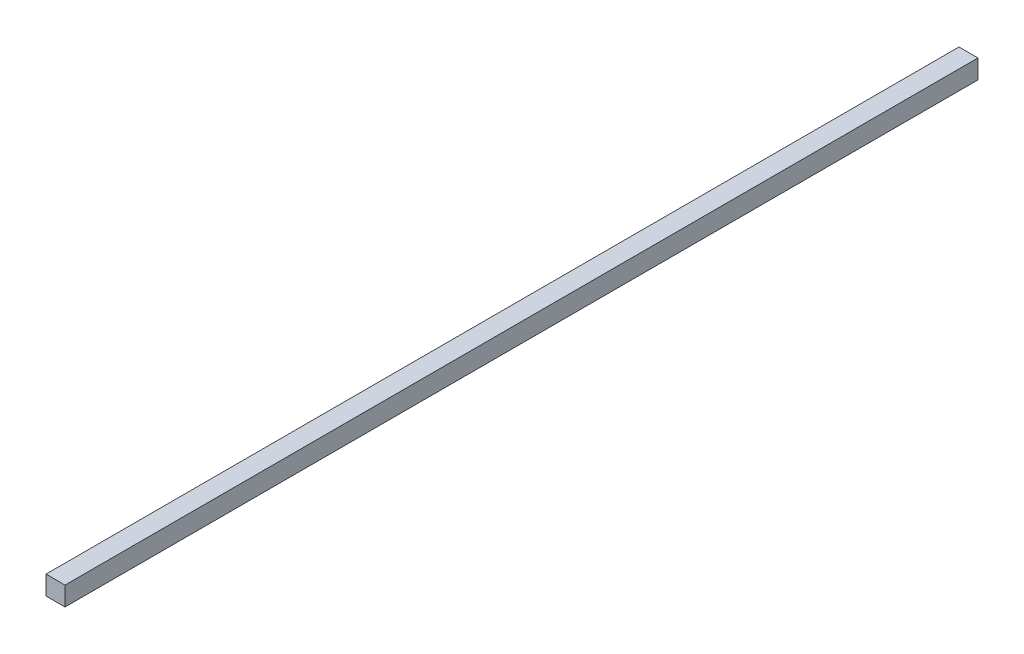
ISO-10303-21;
HEADER;
FILE_DESCRIPTION(('STEP AP214'),'2;1');
FILE_NAME('part.step','',(''),(''),'','','');
FILE_SCHEMA(('AUTOMOTIVE_DESIGN { 1 0 10303 214 1 1 1 1 }'));
ENDSEC;
DATA;
#1=APPLICATION_CONTEXT('core data for automotive mechanical design processes');
#2=APPLICATION_PROTOCOL_DEFINITION('international standard','automotive_design',2000,#1);
#3=PRODUCT_CONTEXT('',#1,'mechanical');
#4=PRODUCT('Part','Part','',(#3));
#5=PRODUCT_RELATED_PRODUCT_CATEGORY('part','',(#4));
#6=PRODUCT_DEFINITION_FORMATION('','',#4);
#7=PRODUCT_DEFINITION_CONTEXT('part definition',#1,'design');
#8=PRODUCT_DEFINITION('design','',#6,#7);
#9=PRODUCT_DEFINITION_SHAPE('','',#8);
#10=(LENGTH_UNIT() NAMED_UNIT(*) SI_UNIT(.MILLI.,.METRE.));
#11=(NAMED_UNIT(*) PLANE_ANGLE_UNIT() SI_UNIT($,.RADIAN.));
#12=(NAMED_UNIT(*) SI_UNIT($,.STERADIAN.) SOLID_ANGLE_UNIT());
#13=UNCERTAINTY_MEASURE_WITH_UNIT(LENGTH_MEASURE(1.E-05),#10,'distance_accuracy_value','');
#14=(GEOMETRIC_REPRESENTATION_CONTEXT(3) GLOBAL_UNCERTAINTY_ASSIGNED_CONTEXT((#13)) GLOBAL_UNIT_ASSIGNED_CONTEXT((#10,
#11,#12)) REPRESENTATION_CONTEXT('',''));
#15=CARTESIAN_POINT('',(0.,0.,0.));
#16=DIRECTION('',(0.,0.,1.));
#17=DIRECTION('',(1.,0.,0.));
#18=AXIS2_PLACEMENT_3D('',#15,#16,#17);
#19=CARTESIAN_POINT('',(0.,0.,152.4));
#20=DIRECTION('',(-1.,0.,0.));
#21=DIRECTION('',(0.,0.,1.));
#22=AXIS2_PLACEMENT_3D('',#19,#20,#21);
#23=PLANE('',#22);
#24=DIRECTION('',(0.,1.,0.));
#25=VECTOR('',#24,1.);
#26=CARTESIAN_POINT('',(0.,0.,-152.4));
#27=LINE('',#26,#25);
#28=CARTESIAN_POINT('',(0.,0.,-152.4));
#29=VERTEX_POINT('',#28);
#30=CARTESIAN_POINT('',(0.,6.35,-152.4));
#31=VERTEX_POINT('',#30);
#32=EDGE_CURVE('E102',#29,#31,#27,.T.);
#33=ORIENTED_EDGE('',*,*,#32,.T.);
#34=DIRECTION('',(0.,0.,-1.));
#35=VECTOR('',#34,1.);
#36=CARTESIAN_POINT('',(0.,6.35,152.4));
#37=LINE('',#36,#35);
#38=CARTESIAN_POINT('',(0.,6.35,152.4));
#39=VERTEX_POINT('',#38);
#40=EDGE_CURVE('E11',#39,#31,#37,.T.);
#41=ORIENTED_EDGE('',*,*,#40,.F.);
#42=DIRECTION('',(0.,1.,0.));
#43=VECTOR('',#42,1.);
#44=CARTESIAN_POINT('',(0.,0.,152.4));
#45=LINE('',#44,#43);
#46=CARTESIAN_POINT('',(0.,0.,152.4));
#47=VERTEX_POINT('',#46);
#48=EDGE_CURVE('E90',#47,#39,#45,.T.);
#49=ORIENTED_EDGE('',*,*,#48,.F.);
#50=DIRECTION('',(0.,0.,-1.));
#51=VECTOR('',#50,1.);
#52=CARTESIAN_POINT('',(0.,0.,152.4));
#53=LINE('',#52,#51);
#54=EDGE_CURVE('E98',#47,#29,#53,.T.);
#55=ORIENTED_EDGE('',*,*,#54,.T.);
#56=EDGE_LOOP('',(#33,#41,#49,#55));
#57=FACE_BOUND('',#56,.T.);
#58=ADVANCED_FACE('F39',(#57),#23,.F.);
#59=CARTESIAN_POINT('',(0.,6.35,152.4));
#60=DIRECTION('',(0.,-1.,0.));
#61=DIRECTION('',(1.,0.,0.));
#62=AXIS2_PLACEMENT_3D('',#59,#60,#61);
#63=PLANE('',#62);
#64=DIRECTION('',(-1.,0.,0.));
#65=VECTOR('',#64,1.);
#66=CARTESIAN_POINT('',(0.,6.35,-152.4));
#67=LINE('',#66,#65);
#68=CARTESIAN_POINT('',(-6.35,6.35,-152.4));
#69=VERTEX_POINT('',#68);
#70=EDGE_CURVE('E94',#31,#69,#67,.T.);
#71=ORIENTED_EDGE('',*,*,#70,.T.);
#72=DIRECTION('',(0.,0.,-1.));
#73=VECTOR('',#72,1.);
#74=CARTESIAN_POINT('',(-6.35,6.35,152.4));
#75=LINE('',#74,#73);
#76=CARTESIAN_POINT('',(-6.35,6.35,152.4));
#77=VERTEX_POINT('',#76);
#78=EDGE_CURVE('E47',#77,#69,#75,.T.);
#79=ORIENTED_EDGE('',*,*,#78,.F.);
#80=DIRECTION('',(-1.,0.,0.));
#81=VECTOR('',#80,1.);
#82=CARTESIAN_POINT('',(0.,6.35,152.4));
#83=LINE('',#82,#81);
#84=EDGE_CURVE('E85',#39,#77,#83,.T.);
#85=ORIENTED_EDGE('',*,*,#84,.F.);
#86=ORIENTED_EDGE('',*,*,#40,.T.);
#87=EDGE_LOOP('',(#71,#79,#85,#86));
#88=FACE_BOUND('',#87,.T.);
#89=ADVANCED_FACE('F93',(#88),#63,.F.);
#90=CARTESIAN_POINT('',(-6.35,0.,152.4));
#91=DIRECTION('',(1.,0.,0.));
#92=DIRECTION('',(0.,0.,-1.));
#93=AXIS2_PLACEMENT_3D('',#90,#91,#92);
#94=PLANE('',#93);
#95=DIRECTION('',(0.,-1.,0.));
#96=VECTOR('',#95,1.);
#97=CARTESIAN_POINT('',(-6.35,0.,-152.4));
#98=LINE('',#97,#96);
#99=CARTESIAN_POINT('',(-6.35,0.,-152.4));
#100=VERTEX_POINT('',#99);
#101=EDGE_CURVE('E72',#69,#100,#98,.T.);
#102=ORIENTED_EDGE('',*,*,#101,.T.);
#103=DIRECTION('',(0.,0.,-1.));
#104=VECTOR('',#103,1.);
#105=CARTESIAN_POINT('',(-6.35,0.,152.4));
#106=LINE('',#105,#104);
#107=CARTESIAN_POINT('',(-6.35,0.,152.4));
#108=VERTEX_POINT('',#107);
#109=EDGE_CURVE('E95',#108,#100,#106,.T.);
#110=ORIENTED_EDGE('',*,*,#109,.F.);
#111=DIRECTION('',(0.,-1.,0.));
#112=VECTOR('',#111,1.);
#113=CARTESIAN_POINT('',(-6.35,0.,152.4));
#114=LINE('',#113,#112);
#115=EDGE_CURVE('E88',#77,#108,#114,.T.);
#116=ORIENTED_EDGE('',*,*,#115,.F.);
#117=ORIENTED_EDGE('',*,*,#78,.T.);
#118=EDGE_LOOP('',(#102,#110,#116,#117));
#119=FACE_BOUND('',#118,.T.);
#120=ADVANCED_FACE('F96',(#119),#94,.F.);
#121=CARTESIAN_POINT('',(0.,0.,152.4));
#122=DIRECTION('',(0.,1.,0.));
#123=DIRECTION('',(-1.,0.,0.));
#124=AXIS2_PLACEMENT_3D('',#121,#122,#123);
#125=PLANE('',#124);
#126=DIRECTION('',(1.,0.,0.));
#127=VECTOR('',#126,1.);
#128=CARTESIAN_POINT('',(0.,0.,-152.4));
#129=LINE('',#128,#127);
#130=EDGE_CURVE('E78',#100,#29,#129,.T.);
#131=ORIENTED_EDGE('',*,*,#130,.T.);
#132=ORIENTED_EDGE('',*,*,#54,.F.);
#133=DIRECTION('',(1.,0.,0.));
#134=VECTOR('',#133,1.);
#135=CARTESIAN_POINT('',(0.,0.,152.4));
#136=LINE('',#135,#134);
#137=EDGE_CURVE('E55',#108,#47,#136,.T.);
#138=ORIENTED_EDGE('',*,*,#137,.F.);
#139=ORIENTED_EDGE('',*,*,#109,.T.);
#140=EDGE_LOOP('',(#131,#132,#138,#139));
#141=FACE_BOUND('',#140,.T.);
#142=ADVANCED_FACE('F109',(#141),#125,.F.);
#143=CARTESIAN_POINT('',(0.,0.,152.4));
#144=DIRECTION('',(0.,0.,1.));
#145=DIRECTION('',(1.,0.,0.));
#146=AXIS2_PLACEMENT_3D('',#143,#144,#145);
#147=PLANE('',#146);
#148=ORIENTED_EDGE('',*,*,#48,.T.);
#149=ORIENTED_EDGE('',*,*,#84,.T.);
#150=ORIENTED_EDGE('',*,*,#115,.T.);
#151=ORIENTED_EDGE('',*,*,#137,.T.);
#152=EDGE_LOOP('',(#148,#149,#150,#151));
#153=FACE_BOUND('',#152,.T.);
#154=ADVANCED_FACE('F86',(#153),#147,.T.);
#155=CARTESIAN_POINT('',(0.,0.,-152.4));
#156=DIRECTION('',(0.,0.,1.));
#157=DIRECTION('',(1.,0.,0.));
#158=AXIS2_PLACEMENT_3D('',#155,#156,#157);
#159=PLANE('',#158);
#160=ORIENTED_EDGE('',*,*,#32,.F.);
#161=ORIENTED_EDGE('',*,*,#130,.F.);
#162=ORIENTED_EDGE('',*,*,#101,.F.);
#163=ORIENTED_EDGE('',*,*,#70,.F.);
#164=EDGE_LOOP('',(#160,#161,#162,#163));
#165=FACE_BOUND('',#164,.T.);
#166=ADVANCED_FACE('F112',(#165),#159,.F.);
#167=CLOSED_SHELL('',(#58,#89,#120,#142,#154,#166));
#168=MANIFOLD_SOLID_BREP('B2',#167);
#169=ADVANCED_BREP_SHAPE_REPRESENTATION('',(#18,#168),#14);
#170=SHAPE_DEFINITION_REPRESENTATION(#9,#169);
ENDSEC;
END-ISO-10303-21;
